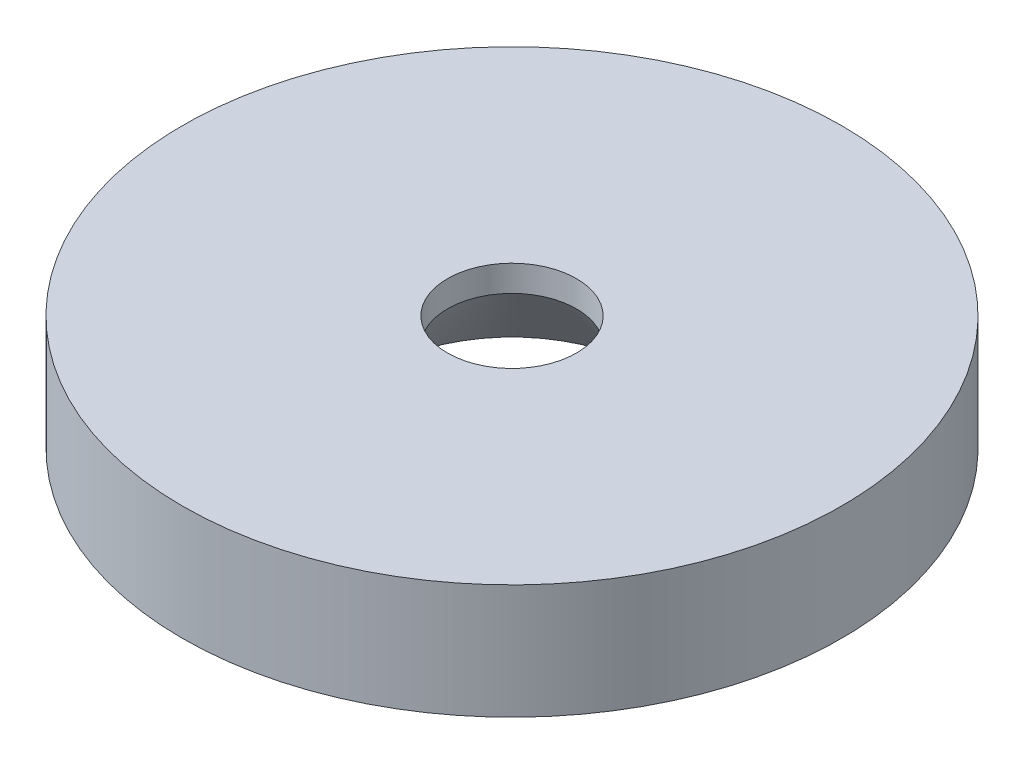
ISO-10303-21;
HEADER;
FILE_DESCRIPTION(('STEP AP214'),'2;1');
FILE_NAME('part.step','',(''),(''),'','','');
FILE_SCHEMA(('AUTOMOTIVE_DESIGN { 1 0 10303 214 1 1 1 1 }'));
ENDSEC;
DATA;
#1=APPLICATION_CONTEXT('core data for automotive mechanical design processes');
#2=APPLICATION_PROTOCOL_DEFINITION('international standard','automotive_design',2000,#1);
#3=PRODUCT_CONTEXT('',#1,'mechanical');
#4=PRODUCT('Part','Part','',(#3));
#5=PRODUCT_RELATED_PRODUCT_CATEGORY('part','',(#4));
#6=PRODUCT_DEFINITION_FORMATION('','',#4);
#7=PRODUCT_DEFINITION_CONTEXT('part definition',#1,'design');
#8=PRODUCT_DEFINITION('design','',#6,#7);
#9=PRODUCT_DEFINITION_SHAPE('','',#8);
#10=(LENGTH_UNIT() NAMED_UNIT(*) SI_UNIT(.MILLI.,.METRE.));
#11=(NAMED_UNIT(*) PLANE_ANGLE_UNIT() SI_UNIT($,.RADIAN.));
#12=(NAMED_UNIT(*) SI_UNIT($,.STERADIAN.) SOLID_ANGLE_UNIT());
#13=UNCERTAINTY_MEASURE_WITH_UNIT(LENGTH_MEASURE(1.E-05),#10,'distance_accuracy_value','');
#14=(GEOMETRIC_REPRESENTATION_CONTEXT(3) GLOBAL_UNCERTAINTY_ASSIGNED_CONTEXT((#13)) GLOBAL_UNIT_ASSIGNED_CONTEXT((#10,
#11,#12)) REPRESENTATION_CONTEXT('',''));
#15=CARTESIAN_POINT('',(0.,0.,0.));
#16=DIRECTION('',(0.,0.,1.));
#17=DIRECTION('',(1.,0.,0.));
#18=AXIS2_PLACEMENT_3D('',#15,#16,#17);
#19=CARTESIAN_POINT('',(0.,4.,0.));
#20=DIRECTION('',(0.,-1.,0.));
#21=DIRECTION('',(0.,0.,-1.));
#22=AXIS2_PLACEMENT_3D('',#19,#20,#21);
#23=CYLINDRICAL_SURFACE('',#22,11.5);
#24=CARTESIAN_POINT('',(0.,4.,0.));
#25=DIRECTION('',(0.,1.,0.));
#26=DIRECTION('',(0.,0.,1.));
#27=AXIS2_PLACEMENT_3D('',#24,#25,#26);
#28=CIRCLE('',#27,11.5);
#29=CARTESIAN_POINT('',(0.,4.,11.5));
#30=VERTEX_POINT('',#29);
#31=EDGE_CURVE('E42',#30,#30,#28,.T.);
#32=ORIENTED_EDGE('',*,*,#31,.F.);
#33=EDGE_LOOP('',(#32));
#34=FACE_BOUND('',#33,.T.);
#35=CARTESIAN_POINT('',(0.,0.,0.));
#36=DIRECTION('',(0.,1.,0.));
#37=DIRECTION('',(0.,0.,1.));
#38=AXIS2_PLACEMENT_3D('',#35,#36,#37);
#39=CIRCLE('',#38,11.5);
#40=CARTESIAN_POINT('',(0.,0.,11.5));
#41=VERTEX_POINT('',#40);
#42=EDGE_CURVE('E46',#41,#41,#39,.T.);
#43=ORIENTED_EDGE('',*,*,#42,.T.);
#44=EDGE_LOOP('',(#43));
#45=FACE_BOUND('',#44,.T.);
#46=ADVANCED_FACE('F31',(#34,#45),#23,.T.);
#47=CARTESIAN_POINT('',(0.,4.,0.));
#48=DIRECTION('',(0.,1.,0.));
#49=DIRECTION('',(0.,0.,1.));
#50=AXIS2_PLACEMENT_3D('',#47,#48,#49);
#51=PLANE('',#50);
#52=CARTESIAN_POINT('',(0.,4.,0.));
#53=DIRECTION('',(0.,1.,0.));
#54=DIRECTION('',(0.,0.,1.));
#55=AXIS2_PLACEMENT_3D('',#52,#53,#54);
#56=CIRCLE('',#55,2.25);
#57=CARTESIAN_POINT('',(0.,4.,2.25));
#58=VERTEX_POINT('',#57);
#59=EDGE_CURVE('E50',#58,#58,#56,.T.);
#60=ORIENTED_EDGE('',*,*,#59,.F.);
#61=EDGE_LOOP('',(#60));
#62=FACE_BOUND('',#61,.T.);
#63=ORIENTED_EDGE('',*,*,#31,.T.);
#64=EDGE_LOOP('',(#63));
#65=FACE_BOUND('',#64,.T.);
#66=ADVANCED_FACE('F57',(#62,#65),#51,.T.);
#67=CARTESIAN_POINT('',(0.,0.,0.));
#68=DIRECTION('',(0.,1.,0.));
#69=DIRECTION('',(0.,0.,1.));
#70=AXIS2_PLACEMENT_3D('',#67,#68,#69);
#71=PLANE('',#70);
#72=CARTESIAN_POINT('',(0.,0.,0.));
#73=DIRECTION('',(0.,1.,0.));
#74=DIRECTION('',(0.,0.,1.));
#75=AXIS2_PLACEMENT_3D('',#72,#73,#74);
#76=CIRCLE('',#75,4.75000000000001);
#77=CARTESIAN_POINT('',(0.,0.,4.75000000000001));
#78=VERTEX_POINT('',#77);
#79=EDGE_CURVE('E38',#78,#78,#76,.T.);
#80=ORIENTED_EDGE('',*,*,#79,.T.);
#81=EDGE_LOOP('',(#80));
#82=FACE_BOUND('',#81,.T.);
#83=ORIENTED_EDGE('',*,*,#42,.F.);
#84=EDGE_LOOP('',(#83));
#85=FACE_BOUND('',#84,.T.);
#86=ADVANCED_FACE('F60',(#82,#85),#71,.F.);
#87=CARTESIAN_POINT('',(0.,0.,0.));
#88=DIRECTION('',(0.,1.,0.));
#89=DIRECTION('',(0.,0.,1.));
#90=AXIS2_PLACEMENT_3D('',#87,#88,#89);
#91=CYLINDRICAL_SURFACE('',#90,2.25);
#92=CARTESIAN_POINT('',(0.,3.08724289133764,0.));
#93=DIRECTION('',(0.,1.,0.));
#94=DIRECTION('',(0.,0.,1.));
#95=AXIS2_PLACEMENT_3D('',#92,#93,#94);
#96=CIRCLE('',#95,2.25);
#97=CARTESIAN_POINT('',(0.,3.08724289133764,2.25));
#98=VERTEX_POINT('',#97);
#99=EDGE_CURVE('E10',#98,#98,#96,.F.);
#100=ORIENTED_EDGE('',*,*,#99,.T.);
#101=EDGE_LOOP('',(#100));
#102=FACE_BOUND('',#101,.T.);
#103=ORIENTED_EDGE('',*,*,#59,.T.);
#104=EDGE_LOOP('',(#103));
#105=FACE_BOUND('',#104,.T.);
#106=ADVANCED_FACE('F55',(#102,#105),#91,.F.);
#107=CARTESIAN_POINT('',(0.,0.,0.));
#108=DIRECTION('',(0.,-1.,0.));
#109=DIRECTION('',(0.,0.,-1.));
#110=AXIS2_PLACEMENT_3D('',#107,#108,#109);
#111=CONICAL_SURFACE('',#110,4.75000000000001,0.68067840827779);
#112=ORIENTED_EDGE('',*,*,#99,.F.);
#113=EDGE_LOOP('',(#112));
#114=FACE_BOUND('',#113,.T.);
#115=ORIENTED_EDGE('',*,*,#79,.F.);
#116=EDGE_LOOP('',(#115));
#117=FACE_BOUND('',#116,.T.);
#118=ADVANCED_FACE('F33',(#114,#117),#111,.F.);
#119=CLOSED_SHELL('',(#46,#66,#86,#106,#118));
#120=MANIFOLD_SOLID_BREP('B2',#119);
#121=ADVANCED_BREP_SHAPE_REPRESENTATION('',(#18,#120),#14);
#122=SHAPE_DEFINITION_REPRESENTATION(#9,#121);
ENDSEC;
END-ISO-10303-21;
